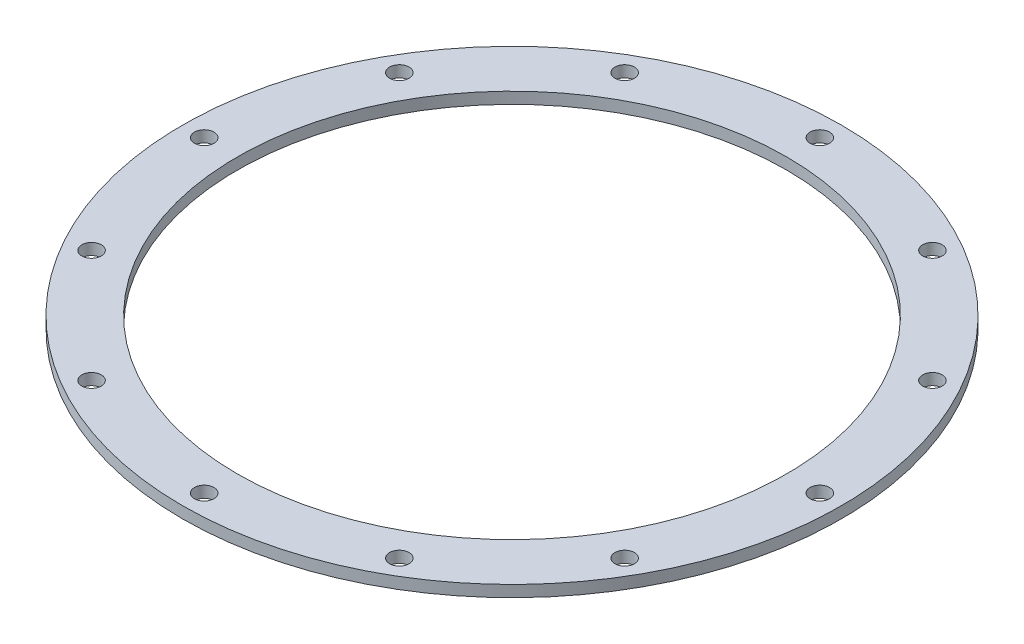
ISO-10303-21;
HEADER;
FILE_DESCRIPTION(('STEP AP214'),'2;1');
FILE_NAME('part.step','',(''),(''),'','','');
FILE_SCHEMA(('AUTOMOTIVE_DESIGN { 1 0 10303 214 1 1 1 1 }'));
ENDSEC;
DATA;
#1=APPLICATION_CONTEXT('core data for automotive mechanical design processes');
#2=APPLICATION_PROTOCOL_DEFINITION('international standard','automotive_design',2000,#1);
#3=PRODUCT_CONTEXT('',#1,'mechanical');
#4=PRODUCT('Part','Part','',(#3));
#5=PRODUCT_RELATED_PRODUCT_CATEGORY('part','',(#4));
#6=PRODUCT_DEFINITION_FORMATION('','',#4);
#7=PRODUCT_DEFINITION_CONTEXT('part definition',#1,'design');
#8=PRODUCT_DEFINITION('design','',#6,#7);
#9=PRODUCT_DEFINITION_SHAPE('','',#8);
#10=(LENGTH_UNIT() NAMED_UNIT(*) SI_UNIT(.MILLI.,.METRE.));
#11=(NAMED_UNIT(*) PLANE_ANGLE_UNIT() SI_UNIT($,.RADIAN.));
#12=(NAMED_UNIT(*) SI_UNIT($,.STERADIAN.) SOLID_ANGLE_UNIT());
#13=UNCERTAINTY_MEASURE_WITH_UNIT(LENGTH_MEASURE(1.E-05),#10,'distance_accuracy_value','');
#14=(GEOMETRIC_REPRESENTATION_CONTEXT(3) GLOBAL_UNCERTAINTY_ASSIGNED_CONTEXT((#13)) GLOBAL_UNIT_ASSIGNED_CONTEXT((#10,
#11,#12)) REPRESENTATION_CONTEXT('',''));
#15=CARTESIAN_POINT('',(0.,0.,0.));
#16=DIRECTION('',(0.,0.,1.));
#17=DIRECTION('',(1.,0.,0.));
#18=AXIS2_PLACEMENT_3D('',#15,#16,#17);
#19=CARTESIAN_POINT('',(0.,55.,0.));
#20=DIRECTION('',(0.,1.,0.));
#21=DIRECTION('',(0.,0.,1.));
#22=AXIS2_PLACEMENT_3D('',#19,#20,#21);
#23=CYLINDRICAL_SURFACE('',#22,38.1);
#24=CARTESIAN_POINT('',(0.,1.58750000000001,0.));
#25=DIRECTION('',(0.,1.,0.));
#26=DIRECTION('',(0.,0.,1.));
#27=AXIS2_PLACEMENT_3D('',#24,#25,#26);
#28=CIRCLE('',#27,38.1);
#29=CARTESIAN_POINT('',(0.,1.58750000000001,38.1));
#30=VERTEX_POINT('',#29);
#31=EDGE_CURVE('E10',#30,#30,#28,.T.);
#32=ORIENTED_EDGE('',*,*,#31,.T.);
#33=EDGE_LOOP('',(#32));
#34=FACE_BOUND('',#33,.T.);
#35=CARTESIAN_POINT('',(0.,0.,0.));
#36=DIRECTION('',(0.,1.,0.));
#37=DIRECTION('',(0.,0.,1.));
#38=AXIS2_PLACEMENT_3D('',#35,#36,#37);
#39=CIRCLE('',#38,38.1);
#40=CARTESIAN_POINT('',(0.,0.,38.1));
#41=VERTEX_POINT('',#40);
#42=EDGE_CURVE('E51',#41,#41,#39,.T.);
#43=ORIENTED_EDGE('',*,*,#42,.F.);
#44=EDGE_LOOP('',(#43));
#45=FACE_BOUND('',#44,.T.);
#46=ADVANCED_FACE('F37',(#34,#45),#23,.F.);
#47=CARTESIAN_POINT('',(-38.1,1.5875,0.));
#48=DIRECTION('',(0.,1.,0.));
#49=DIRECTION('',(0.,0.,1.));
#50=AXIS2_PLACEMENT_3D('',#47,#48,#49);
#51=PLANE('',#50);
#52=CARTESIAN_POINT('',(-36.9797827062029,1.58750000000001,21.3502874999996));
#53=DIRECTION('',(0.,-1.,0.));
#54=DIRECTION('',(0.,0.,-1.));
#55=AXIS2_PLACEMENT_3D('',#52,#53,#54);
#56=CIRCLE('',#55,1.35255);
#57=CARTESIAN_POINT('',(-36.9797827062029,1.58750000000001,19.9977374999996));
#58=VERTEX_POINT('',#57);
#59=EDGE_CURVE('E122',#58,#58,#56,.T.);
#60=ORIENTED_EDGE('',*,*,#59,.T.);
#61=EDGE_LOOP('',(#60));
#62=FACE_BOUND('',#61,.T.);
#63=CARTESIAN_POINT('',(-21.3502875000004,1.58750000000001,36.9797827062025));
#64=DIRECTION('',(0.,-1.,0.));
#65=DIRECTION('',(0.,0.,-1.));
#66=AXIS2_PLACEMENT_3D('',#63,#64,#65);
#67=CIRCLE('',#66,1.35255);
#68=CARTESIAN_POINT('',(-21.3502875000004,1.58750000000001,35.6272327062025));
#69=VERTEX_POINT('',#68);
#70=EDGE_CURVE('E116',#69,#69,#67,.T.);
#71=ORIENTED_EDGE('',*,*,#70,.T.);
#72=EDGE_LOOP('',(#71));
#73=FACE_BOUND('',#72,.T.);
#74=CARTESIAN_POINT('',(-3.66184011613991E-13,1.58750000000001,42.700575));
#75=DIRECTION('',(0.,-1.,0.));
#76=DIRECTION('',(0.,0.,-1.));
#77=AXIS2_PLACEMENT_3D('',#74,#75,#76);
#78=CIRCLE('',#77,1.35255);
#79=CARTESIAN_POINT('',(-3.66184011613991E-13,1.58750000000001,41.348025));
#80=VERTEX_POINT('',#79);
#81=EDGE_CURVE('E110',#80,#80,#78,.T.);
#82=ORIENTED_EDGE('',*,*,#81,.T.);
#83=EDGE_LOOP('',(#82));
#84=FACE_BOUND('',#83,.T.);
#85=CARTESIAN_POINT('',(21.3502874999997,1.58750000000001,36.9797827062029));
#86=DIRECTION('',(0.,-1.,0.));
#87=DIRECTION('',(0.,0.,-1.));
#88=AXIS2_PLACEMENT_3D('',#85,#86,#87);
#89=CIRCLE('',#88,1.35255);
#90=CARTESIAN_POINT('',(21.3502874999997,1.58750000000001,35.6272327062029));
#91=VERTEX_POINT('',#90);
#92=EDGE_CURVE('E104',#91,#91,#89,.T.);
#93=ORIENTED_EDGE('',*,*,#92,.T.);
#94=EDGE_LOOP('',(#93));
#95=FACE_BOUND('',#94,.T.);
#96=CARTESIAN_POINT('',(36.9797827062026,1.58750000000001,21.3502875000002));
#97=DIRECTION('',(0.,-1.,0.));
#98=DIRECTION('',(0.,0.,-1.));
#99=AXIS2_PLACEMENT_3D('',#96,#97,#98);
#100=CIRCLE('',#99,1.35255);
#101=CARTESIAN_POINT('',(36.9797827062026,1.58750000000001,19.9977375000002));
#102=VERTEX_POINT('',#101);
#103=EDGE_CURVE('E98',#102,#102,#100,.T.);
#104=ORIENTED_EDGE('',*,*,#103,.T.);
#105=EDGE_LOOP('',(#104));
#106=FACE_BOUND('',#105,.T.);
#107=CARTESIAN_POINT('',(42.700575,1.58750000000001,2.36058615455513E-13));
#108=DIRECTION('',(0.,-1.,0.));
#109=DIRECTION('',(0.,0.,-1.));
#110=AXIS2_PLACEMENT_3D('',#107,#108,#109);
#111=CIRCLE('',#110,1.35255);
#112=CARTESIAN_POINT('',(42.700575,1.58750000000001,-1.35254999999976));
#113=VERTEX_POINT('',#112);
#114=EDGE_CURVE('E92',#113,#113,#111,.T.);
#115=ORIENTED_EDGE('',*,*,#114,.T.);
#116=EDGE_LOOP('',(#115));
#117=FACE_BOUND('',#116,.T.);
#118=CARTESIAN_POINT('',(36.9797827062028,1.58750000000001,-21.3502874999998));
#119=DIRECTION('',(0.,-1.,0.));
#120=DIRECTION('',(0.,0.,-1.));
#121=AXIS2_PLACEMENT_3D('',#118,#119,#120);
#122=CIRCLE('',#121,1.35255);
#123=CARTESIAN_POINT('',(36.9797827062028,1.58750000000001,-22.7028374999998));
#124=VERTEX_POINT('',#123);
#125=EDGE_CURVE('E86',#124,#124,#122,.T.);
#126=ORIENTED_EDGE('',*,*,#125,.T.);
#127=EDGE_LOOP('',(#126));
#128=FACE_BOUND('',#127,.T.);
#129=CARTESIAN_POINT('',(21.3502875000001,1.58750000000001,-36.9797827062026));
#130=DIRECTION('',(0.,-1.,0.));
#131=DIRECTION('',(0.,0.,-1.));
#132=AXIS2_PLACEMENT_3D('',#129,#130,#131);
#133=CIRCLE('',#132,1.35255);
#134=CARTESIAN_POINT('',(21.3502875000001,1.58750000000001,-38.3323327062026));
#135=VERTEX_POINT('',#134);
#136=EDGE_CURVE('E80',#135,#135,#133,.T.);
#137=ORIENTED_EDGE('',*,*,#136,.T.);
#138=EDGE_LOOP('',(#137));
#139=FACE_BOUND('',#138,.T.);
#140=CARTESIAN_POINT('',(1.15414651602981E-13,1.58750000000001,-42.700575));
#141=DIRECTION('',(0.,-1.,0.));
#142=DIRECTION('',(0.,0.,-1.));
#143=AXIS2_PLACEMENT_3D('',#140,#141,#142);
#144=CIRCLE('',#143,1.35255);
#145=CARTESIAN_POINT('',(1.15414651602981E-13,1.58750000000001,-44.053125));
#146=VERTEX_POINT('',#145);
#147=EDGE_CURVE('E74',#146,#146,#144,.T.);
#148=ORIENTED_EDGE('',*,*,#147,.T.);
#149=EDGE_LOOP('',(#148));
#150=FACE_BOUND('',#149,.T.);
#151=CARTESIAN_POINT('',(-21.3502874999999,1.58750000000001,-36.9797827062027));
#152=DIRECTION('',(0.,-1.,0.));
#153=DIRECTION('',(0.,0.,-1.));
#154=AXIS2_PLACEMENT_3D('',#151,#152,#153);
#155=CIRCLE('',#154,1.35255);
#156=CARTESIAN_POINT('',(-21.3502874999999,1.58750000000001,-38.3323327062027));
#157=VERTEX_POINT('',#156);
#158=EDGE_CURVE('E68',#157,#157,#155,.T.);
#159=ORIENTED_EDGE('',*,*,#158,.T.);
#160=EDGE_LOOP('',(#159));
#161=FACE_BOUND('',#160,.T.);
#162=CARTESIAN_POINT('',(-36.9797827062027,1.58750000000001,-21.3502875));
#163=DIRECTION('',(0.,-1.,0.));
#164=DIRECTION('',(0.,0.,-1.));
#165=AXIS2_PLACEMENT_3D('',#162,#163,#164);
#166=CIRCLE('',#165,1.35255);
#167=CARTESIAN_POINT('',(-36.9797827062027,1.58750000000001,-22.7028375));
#168=VERTEX_POINT('',#167);
#169=EDGE_CURVE('E62',#168,#168,#166,.T.);
#170=ORIENTED_EDGE('',*,*,#169,.T.);
#171=EDGE_LOOP('',(#170));
#172=FACE_BOUND('',#171,.T.);
#173=CARTESIAN_POINT('',(-42.700575,1.58750000000001,0.));
#174=DIRECTION('',(0.,-1.,0.));
#175=DIRECTION('',(0.,0.,-1.));
#176=AXIS2_PLACEMENT_3D('',#173,#174,#175);
#177=CIRCLE('',#176,1.35255);
#178=CARTESIAN_POINT('',(-42.700575,1.58750000000001,-1.35255));
#179=VERTEX_POINT('',#178);
#180=EDGE_CURVE('E56',#179,#179,#177,.T.);
#181=ORIENTED_EDGE('',*,*,#180,.T.);
#182=EDGE_LOOP('',(#181));
#183=FACE_BOUND('',#182,.T.);
#184=CARTESIAN_POINT('',(0.,1.5875,0.));
#185=DIRECTION('',(0.,1.,0.));
#186=DIRECTION('',(0.,0.,1.));
#187=AXIS2_PLACEMENT_3D('',#184,#185,#186);
#188=CIRCLE('',#187,45.72);
#189=CARTESIAN_POINT('',(0.,1.5875,45.72));
#190=VERTEX_POINT('',#189);
#191=EDGE_CURVE('E43',#190,#190,#188,.T.);
#192=ORIENTED_EDGE('',*,*,#191,.T.);
#193=EDGE_LOOP('',(#192));
#194=FACE_BOUND('',#193,.T.);
#195=ORIENTED_EDGE('',*,*,#31,.F.);
#196=EDGE_LOOP('',(#195));
#197=FACE_BOUND('',#196,.T.);
#198=ADVANCED_FACE('F165',(#62,#73,#84,#95,#106,#117,#128,#139,#150,#161,#172,#183,#194,#197),
#51,.T.);
#199=CARTESIAN_POINT('',(0.,55.,0.));
#200=DIRECTION('',(0.,1.,0.));
#201=DIRECTION('',(0.,0.,1.));
#202=AXIS2_PLACEMENT_3D('',#199,#200,#201);
#203=CYLINDRICAL_SURFACE('',#202,45.72);
#204=CARTESIAN_POINT('',(0.,0.,0.));
#205=DIRECTION('',(0.,1.,0.));
#206=DIRECTION('',(0.,0.,1.));
#207=AXIS2_PLACEMENT_3D('',#204,#205,#206);
#208=CIRCLE('',#207,45.72);
#209=CARTESIAN_POINT('',(0.,0.,45.72));
#210=VERTEX_POINT('',#209);
#211=EDGE_CURVE('E47',#210,#210,#208,.T.);
#212=ORIENTED_EDGE('',*,*,#211,.T.);
#213=EDGE_LOOP('',(#212));
#214=FACE_BOUND('',#213,.T.);
#215=ORIENTED_EDGE('',*,*,#191,.F.);
#216=EDGE_LOOP('',(#215));
#217=FACE_BOUND('',#216,.T.);
#218=ADVANCED_FACE('F135',(#214,#217),#203,.T.);
#219=CARTESIAN_POINT('',(-38.1,0.,0.));
#220=DIRECTION('',(0.,-1.,0.));
#221=DIRECTION('',(0.,0.,-1.));
#222=AXIS2_PLACEMENT_3D('',#219,#220,#221);
#223=PLANE('',#222);
#224=CARTESIAN_POINT('',(-36.9797827062029,0.,21.3502874999996));
#225=DIRECTION('',(0.,-1.,0.));
#226=DIRECTION('',(0.,0.,-1.));
#227=AXIS2_PLACEMENT_3D('',#224,#225,#226);
#228=CIRCLE('',#227,1.35255);
#229=CARTESIAN_POINT('',(-36.9797827062029,0.,19.9977374999996));
#230=VERTEX_POINT('',#229);
#231=EDGE_CURVE('E125',#230,#230,#228,.T.);
#232=ORIENTED_EDGE('',*,*,#231,.F.);
#233=EDGE_LOOP('',(#232));
#234=FACE_BOUND('',#233,.T.);
#235=CARTESIAN_POINT('',(-21.3502875000004,0.,36.9797827062025));
#236=DIRECTION('',(0.,-1.,0.));
#237=DIRECTION('',(0.,0.,-1.));
#238=AXIS2_PLACEMENT_3D('',#235,#236,#237);
#239=CIRCLE('',#238,1.35255);
#240=CARTESIAN_POINT('',(-21.3502875000004,0.,35.6272327062025));
#241=VERTEX_POINT('',#240);
#242=EDGE_CURVE('E119',#241,#241,#239,.T.);
#243=ORIENTED_EDGE('',*,*,#242,.F.);
#244=EDGE_LOOP('',(#243));
#245=FACE_BOUND('',#244,.T.);
#246=CARTESIAN_POINT('',(-3.66184011613991E-13,0.,42.700575));
#247=DIRECTION('',(0.,-1.,0.));
#248=DIRECTION('',(0.,0.,-1.));
#249=AXIS2_PLACEMENT_3D('',#246,#247,#248);
#250=CIRCLE('',#249,1.35255);
#251=CARTESIAN_POINT('',(-3.66184011613991E-13,0.,41.348025));
#252=VERTEX_POINT('',#251);
#253=EDGE_CURVE('E113',#252,#252,#250,.T.);
#254=ORIENTED_EDGE('',*,*,#253,.F.);
#255=EDGE_LOOP('',(#254));
#256=FACE_BOUND('',#255,.T.);
#257=CARTESIAN_POINT('',(21.3502874999997,0.,36.9797827062029));
#258=DIRECTION('',(0.,-1.,0.));
#259=DIRECTION('',(0.,0.,-1.));
#260=AXIS2_PLACEMENT_3D('',#257,#258,#259);
#261=CIRCLE('',#260,1.35255);
#262=CARTESIAN_POINT('',(21.3502874999997,0.,35.6272327062029));
#263=VERTEX_POINT('',#262);
#264=EDGE_CURVE('E107',#263,#263,#261,.T.);
#265=ORIENTED_EDGE('',*,*,#264,.F.);
#266=EDGE_LOOP('',(#265));
#267=FACE_BOUND('',#266,.T.);
#268=CARTESIAN_POINT('',(36.9797827062026,0.,21.3502875000002));
#269=DIRECTION('',(0.,-1.,0.));
#270=DIRECTION('',(0.,0.,-1.));
#271=AXIS2_PLACEMENT_3D('',#268,#269,#270);
#272=CIRCLE('',#271,1.35255);
#273=CARTESIAN_POINT('',(36.9797827062026,0.,19.9977375000002));
#274=VERTEX_POINT('',#273);
#275=EDGE_CURVE('E101',#274,#274,#272,.T.);
#276=ORIENTED_EDGE('',*,*,#275,.F.);
#277=EDGE_LOOP('',(#276));
#278=FACE_BOUND('',#277,.T.);
#279=CARTESIAN_POINT('',(42.700575,0.,2.36058615455513E-13));
#280=DIRECTION('',(0.,-1.,0.));
#281=DIRECTION('',(0.,0.,-1.));
#282=AXIS2_PLACEMENT_3D('',#279,#280,#281);
#283=CIRCLE('',#282,1.35255);
#284=CARTESIAN_POINT('',(42.700575,0.,-1.35254999999976));
#285=VERTEX_POINT('',#284);
#286=EDGE_CURVE('E95',#285,#285,#283,.T.);
#287=ORIENTED_EDGE('',*,*,#286,.F.);
#288=EDGE_LOOP('',(#287));
#289=FACE_BOUND('',#288,.T.);
#290=CARTESIAN_POINT('',(36.9797827062028,0.,-21.3502874999998));
#291=DIRECTION('',(0.,-1.,0.));
#292=DIRECTION('',(0.,0.,-1.));
#293=AXIS2_PLACEMENT_3D('',#290,#291,#292);
#294=CIRCLE('',#293,1.35255);
#295=CARTESIAN_POINT('',(36.9797827062028,0.,-22.7028374999998));
#296=VERTEX_POINT('',#295);
#297=EDGE_CURVE('E89',#296,#296,#294,.T.);
#298=ORIENTED_EDGE('',*,*,#297,.F.);
#299=EDGE_LOOP('',(#298));
#300=FACE_BOUND('',#299,.T.);
#301=CARTESIAN_POINT('',(21.3502875000001,0.,-36.9797827062026));
#302=DIRECTION('',(0.,-1.,0.));
#303=DIRECTION('',(0.,0.,-1.));
#304=AXIS2_PLACEMENT_3D('',#301,#302,#303);
#305=CIRCLE('',#304,1.35255);
#306=CARTESIAN_POINT('',(21.3502875000001,0.,-38.3323327062026));
#307=VERTEX_POINT('',#306);
#308=EDGE_CURVE('E83',#307,#307,#305,.T.);
#309=ORIENTED_EDGE('',*,*,#308,.F.);
#310=EDGE_LOOP('',(#309));
#311=FACE_BOUND('',#310,.T.);
#312=CARTESIAN_POINT('',(1.15414651602981E-13,0.,-42.700575));
#313=DIRECTION('',(0.,-1.,0.));
#314=DIRECTION('',(0.,0.,-1.));
#315=AXIS2_PLACEMENT_3D('',#312,#313,#314);
#316=CIRCLE('',#315,1.35255);
#317=CARTESIAN_POINT('',(1.15414651602981E-13,0.,-44.053125));
#318=VERTEX_POINT('',#317);
#319=EDGE_CURVE('E77',#318,#318,#316,.T.);
#320=ORIENTED_EDGE('',*,*,#319,.F.);
#321=EDGE_LOOP('',(#320));
#322=FACE_BOUND('',#321,.T.);
#323=CARTESIAN_POINT('',(-21.3502874999999,0.,-36.9797827062027));
#324=DIRECTION('',(0.,-1.,0.));
#325=DIRECTION('',(0.,0.,-1.));
#326=AXIS2_PLACEMENT_3D('',#323,#324,#325);
#327=CIRCLE('',#326,1.35255);
#328=CARTESIAN_POINT('',(-21.3502874999999,0.,-38.3323327062027));
#329=VERTEX_POINT('',#328);
#330=EDGE_CURVE('E71',#329,#329,#327,.T.);
#331=ORIENTED_EDGE('',*,*,#330,.F.);
#332=EDGE_LOOP('',(#331));
#333=FACE_BOUND('',#332,.T.);
#334=CARTESIAN_POINT('',(-36.9797827062027,0.,-21.3502875));
#335=DIRECTION('',(0.,-1.,0.));
#336=DIRECTION('',(0.,0.,-1.));
#337=AXIS2_PLACEMENT_3D('',#334,#335,#336);
#338=CIRCLE('',#337,1.35255);
#339=CARTESIAN_POINT('',(-36.9797827062027,0.,-22.7028375));
#340=VERTEX_POINT('',#339);
#341=EDGE_CURVE('E65',#340,#340,#338,.T.);
#342=ORIENTED_EDGE('',*,*,#341,.F.);
#343=EDGE_LOOP('',(#342));
#344=FACE_BOUND('',#343,.T.);
#345=CARTESIAN_POINT('',(-42.700575,0.,0.));
#346=DIRECTION('',(0.,-1.,0.));
#347=DIRECTION('',(0.,0.,-1.));
#348=AXIS2_PLACEMENT_3D('',#345,#346,#347);
#349=CIRCLE('',#348,1.35255);
#350=CARTESIAN_POINT('',(-42.700575,0.,-1.35255));
#351=VERTEX_POINT('',#350);
#352=EDGE_CURVE('E59',#351,#351,#349,.T.);
#353=ORIENTED_EDGE('',*,*,#352,.F.);
#354=EDGE_LOOP('',(#353));
#355=FACE_BOUND('',#354,.T.);
#356=ORIENTED_EDGE('',*,*,#42,.T.);
#357=EDGE_LOOP('',(#356));
#358=FACE_BOUND('',#357,.T.);
#359=ORIENTED_EDGE('',*,*,#211,.F.);
#360=EDGE_LOOP('',(#359));
#361=FACE_BOUND('',#360,.T.);
#362=ADVANCED_FACE('F131',(#234,#245,#256,#267,#278,#289,#300,#311,#322,#333,#344,#355,#358,
#361),#223,.T.);
#363=CARTESIAN_POINT('',(-42.700575,0.,0.));
#364=DIRECTION('',(0.,-1.,0.));
#365=DIRECTION('',(0.,0.,-1.));
#366=AXIS2_PLACEMENT_3D('',#363,#364,#365);
#367=CYLINDRICAL_SURFACE('',#366,1.35255);
#368=ORIENTED_EDGE('',*,*,#180,.F.);
#369=EDGE_LOOP('',(#368));
#370=FACE_BOUND('',#369,.T.);
#371=ORIENTED_EDGE('',*,*,#352,.T.);
#372=EDGE_LOOP('',(#371));
#373=FACE_BOUND('',#372,.T.);
#374=ADVANCED_FACE('F134',(#370,#373),#367,.F.);
#375=CARTESIAN_POINT('',(-36.9797827062027,0.,-21.3502875));
#376=DIRECTION('',(0.,-1.,0.));
#377=DIRECTION('',(0.,0.,-1.));
#378=AXIS2_PLACEMENT_3D('',#375,#376,#377);
#379=CYLINDRICAL_SURFACE('',#378,1.35255);
#380=ORIENTED_EDGE('',*,*,#169,.F.);
#381=EDGE_LOOP('',(#380));
#382=FACE_BOUND('',#381,.T.);
#383=ORIENTED_EDGE('',*,*,#341,.T.);
#384=EDGE_LOOP('',(#383));
#385=FACE_BOUND('',#384,.T.);
#386=ADVANCED_FACE('F196',(#382,#385),#379,.F.);
#387=CARTESIAN_POINT('',(-21.3502874999999,0.,-36.9797827062027));
#388=DIRECTION('',(0.,-1.,0.));
#389=DIRECTION('',(0.,0.,-1.));
#390=AXIS2_PLACEMENT_3D('',#387,#388,#389);
#391=CYLINDRICAL_SURFACE('',#390,1.35255);
#392=ORIENTED_EDGE('',*,*,#158,.F.);
#393=EDGE_LOOP('',(#392));
#394=FACE_BOUND('',#393,.T.);
#395=ORIENTED_EDGE('',*,*,#330,.T.);
#396=EDGE_LOOP('',(#395));
#397=FACE_BOUND('',#396,.T.);
#398=ADVANCED_FACE('F201',(#394,#397),#391,.F.);
#399=CARTESIAN_POINT('',(1.15414651602981E-13,0.,-42.700575));
#400=DIRECTION('',(0.,-1.,0.));
#401=DIRECTION('',(0.,0.,-1.));
#402=AXIS2_PLACEMENT_3D('',#399,#400,#401);
#403=CYLINDRICAL_SURFACE('',#402,1.35255);
#404=ORIENTED_EDGE('',*,*,#147,.F.);
#405=EDGE_LOOP('',(#404));
#406=FACE_BOUND('',#405,.T.);
#407=ORIENTED_EDGE('',*,*,#319,.T.);
#408=EDGE_LOOP('',(#407));
#409=FACE_BOUND('',#408,.T.);
#410=ADVANCED_FACE('F211',(#406,#409),#403,.F.);
#411=CARTESIAN_POINT('',(21.3502875000001,0.,-36.9797827062026));
#412=DIRECTION('',(0.,-1.,0.));
#413=DIRECTION('',(0.,0.,-1.));
#414=AXIS2_PLACEMENT_3D('',#411,#412,#413);
#415=CYLINDRICAL_SURFACE('',#414,1.35255);
#416=ORIENTED_EDGE('',*,*,#136,.F.);
#417=EDGE_LOOP('',(#416));
#418=FACE_BOUND('',#417,.T.);
#419=ORIENTED_EDGE('',*,*,#308,.T.);
#420=EDGE_LOOP('',(#419));
#421=FACE_BOUND('',#420,.T.);
#422=ADVANCED_FACE('F221',(#418,#421),#415,.F.);
#423=CARTESIAN_POINT('',(36.9797827062028,0.,-21.3502874999998));
#424=DIRECTION('',(0.,-1.,0.));
#425=DIRECTION('',(0.,0.,-1.));
#426=AXIS2_PLACEMENT_3D('',#423,#424,#425);
#427=CYLINDRICAL_SURFACE('',#426,1.35255);
#428=ORIENTED_EDGE('',*,*,#125,.F.);
#429=EDGE_LOOP('',(#428));
#430=FACE_BOUND('',#429,.T.);
#431=ORIENTED_EDGE('',*,*,#297,.T.);
#432=EDGE_LOOP('',(#431));
#433=FACE_BOUND('',#432,.T.);
#434=ADVANCED_FACE('F231',(#430,#433),#427,.F.);
#435=CARTESIAN_POINT('',(42.700575,0.,2.36058615455513E-13));
#436=DIRECTION('',(0.,-1.,0.));
#437=DIRECTION('',(0.,0.,-1.));
#438=AXIS2_PLACEMENT_3D('',#435,#436,#437);
#439=CYLINDRICAL_SURFACE('',#438,1.35255);
#440=ORIENTED_EDGE('',*,*,#114,.F.);
#441=EDGE_LOOP('',(#440));
#442=FACE_BOUND('',#441,.T.);
#443=ORIENTED_EDGE('',*,*,#286,.T.);
#444=EDGE_LOOP('',(#443));
#445=FACE_BOUND('',#444,.T.);
#446=ADVANCED_FACE('F241',(#442,#445),#439,.F.);
#447=CARTESIAN_POINT('',(36.9797827062026,0.,21.3502875000002));
#448=DIRECTION('',(0.,-1.,0.));
#449=DIRECTION('',(0.,0.,-1.));
#450=AXIS2_PLACEMENT_3D('',#447,#448,#449);
#451=CYLINDRICAL_SURFACE('',#450,1.35255);
#452=ORIENTED_EDGE('',*,*,#103,.F.);
#453=EDGE_LOOP('',(#452));
#454=FACE_BOUND('',#453,.T.);
#455=ORIENTED_EDGE('',*,*,#275,.T.);
#456=EDGE_LOOP('',(#455));
#457=FACE_BOUND('',#456,.T.);
#458=ADVANCED_FACE('F251',(#454,#457),#451,.F.);
#459=CARTESIAN_POINT('',(21.3502874999997,0.,36.9797827062029));
#460=DIRECTION('',(0.,-1.,0.));
#461=DIRECTION('',(0.,0.,-1.));
#462=AXIS2_PLACEMENT_3D('',#459,#460,#461);
#463=CYLINDRICAL_SURFACE('',#462,1.35255);
#464=ORIENTED_EDGE('',*,*,#92,.F.);
#465=EDGE_LOOP('',(#464));
#466=FACE_BOUND('',#465,.T.);
#467=ORIENTED_EDGE('',*,*,#264,.T.);
#468=EDGE_LOOP('',(#467));
#469=FACE_BOUND('',#468,.T.);
#470=ADVANCED_FACE('F261',(#466,#469),#463,.F.);
#471=CARTESIAN_POINT('',(-3.66184011613991E-13,0.,42.700575));
#472=DIRECTION('',(0.,-1.,0.));
#473=DIRECTION('',(0.,0.,-1.));
#474=AXIS2_PLACEMENT_3D('',#471,#472,#473);
#475=CYLINDRICAL_SURFACE('',#474,1.35255);
#476=ORIENTED_EDGE('',*,*,#81,.F.);
#477=EDGE_LOOP('',(#476));
#478=FACE_BOUND('',#477,.T.);
#479=ORIENTED_EDGE('',*,*,#253,.T.);
#480=EDGE_LOOP('',(#479));
#481=FACE_BOUND('',#480,.T.);
#482=ADVANCED_FACE('F271',(#478,#481),#475,.F.);
#483=CARTESIAN_POINT('',(-21.3502875000004,0.,36.9797827062025));
#484=DIRECTION('',(0.,-1.,0.));
#485=DIRECTION('',(0.,0.,-1.));
#486=AXIS2_PLACEMENT_3D('',#483,#484,#485);
#487=CYLINDRICAL_SURFACE('',#486,1.35255);
#488=ORIENTED_EDGE('',*,*,#70,.F.);
#489=EDGE_LOOP('',(#488));
#490=FACE_BOUND('',#489,.T.);
#491=ORIENTED_EDGE('',*,*,#242,.T.);
#492=EDGE_LOOP('',(#491));
#493=FACE_BOUND('',#492,.T.);
#494=ADVANCED_FACE('F281',(#490,#493),#487,.F.);
#495=CARTESIAN_POINT('',(-36.9797827062029,0.,21.3502874999996));
#496=DIRECTION('',(0.,-1.,0.));
#497=DIRECTION('',(0.,0.,-1.));
#498=AXIS2_PLACEMENT_3D('',#495,#496,#497);
#499=CYLINDRICAL_SURFACE('',#498,1.35255);
#500=ORIENTED_EDGE('',*,*,#59,.F.);
#501=EDGE_LOOP('',(#500));
#502=FACE_BOUND('',#501,.T.);
#503=ORIENTED_EDGE('',*,*,#231,.T.);
#504=EDGE_LOOP('',(#503));
#505=FACE_BOUND('',#504,.T.);
#506=ADVANCED_FACE('F129',(#502,#505),#499,.F.);
#507=CLOSED_SHELL('',(#46,#198,#218,#362,#374,#386,#398,#410,#422,#434,#446,#458,#470,#482,#494,#506));
#508=MANIFOLD_SOLID_BREP('B2',#507);
#509=ADVANCED_BREP_SHAPE_REPRESENTATION('',(#18,#508),#14);
#510=SHAPE_DEFINITION_REPRESENTATION(#9,#509);
ENDSEC;
END-ISO-10303-21;
